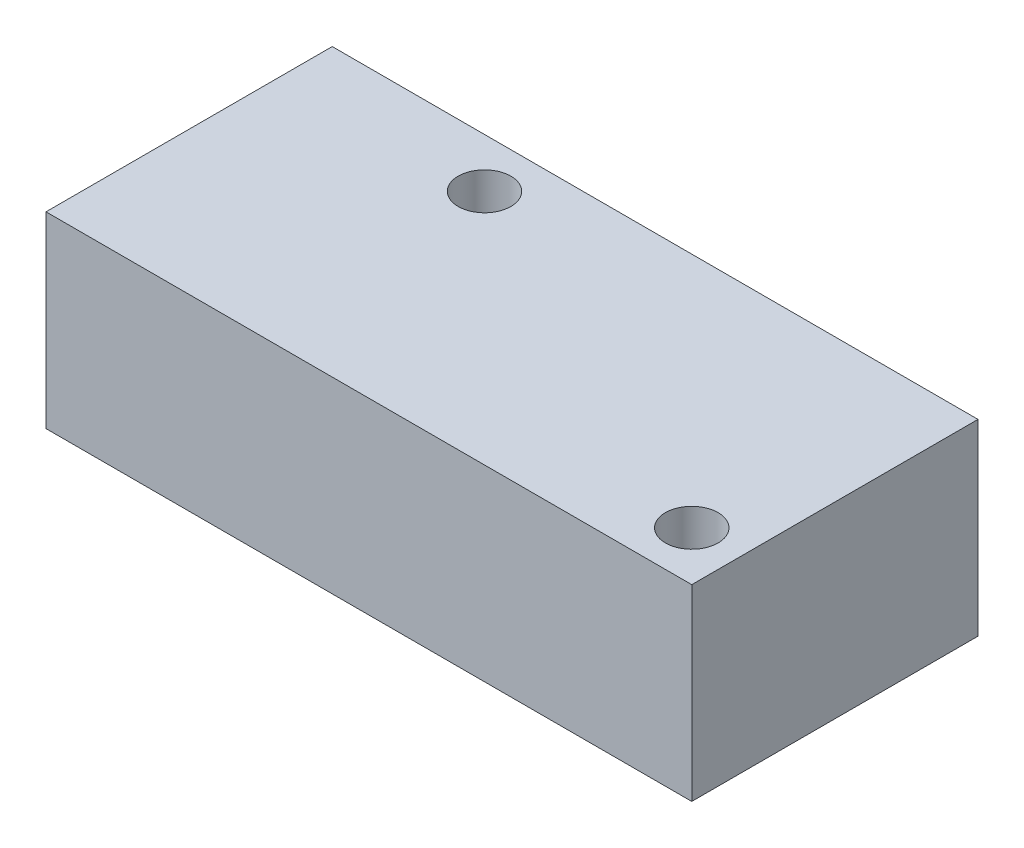
ISO-10303-21;
HEADER;
FILE_DESCRIPTION(('STEP AP214'),'2;1');
FILE_NAME('part.step','',(''),(''),'','','');
FILE_SCHEMA(('AUTOMOTIVE_DESIGN { 1 0 10303 214 1 1 1 1 }'));
ENDSEC;
DATA;
#1=APPLICATION_CONTEXT('core data for automotive mechanical design processes');
#2=APPLICATION_PROTOCOL_DEFINITION('international standard','automotive_design',2000,#1);
#3=PRODUCT_CONTEXT('',#1,'mechanical');
#4=PRODUCT('Part','Part','',(#3));
#5=PRODUCT_RELATED_PRODUCT_CATEGORY('part','',(#4));
#6=PRODUCT_DEFINITION_FORMATION('','',#4);
#7=PRODUCT_DEFINITION_CONTEXT('part definition',#1,'design');
#8=PRODUCT_DEFINITION('design','',#6,#7);
#9=PRODUCT_DEFINITION_SHAPE('','',#8);
#10=(LENGTH_UNIT() NAMED_UNIT(*) SI_UNIT(.MILLI.,.METRE.));
#11=(NAMED_UNIT(*) PLANE_ANGLE_UNIT() SI_UNIT($,.RADIAN.));
#12=(NAMED_UNIT(*) SI_UNIT($,.STERADIAN.) SOLID_ANGLE_UNIT());
#13=UNCERTAINTY_MEASURE_WITH_UNIT(LENGTH_MEASURE(1.E-05),#10,'distance_accuracy_value','');
#14=(GEOMETRIC_REPRESENTATION_CONTEXT(3) GLOBAL_UNCERTAINTY_ASSIGNED_CONTEXT((#13)) GLOBAL_UNIT_ASSIGNED_CONTEXT((#10,
#11,#12)) REPRESENTATION_CONTEXT('',''));
#15=CARTESIAN_POINT('',(0.,0.,0.));
#16=DIRECTION('',(0.,0.,1.));
#17=DIRECTION('',(1.,0.,0.));
#18=AXIS2_PLACEMENT_3D('',#15,#16,#17);
#19=CARTESIAN_POINT('',(0.,10.414,0.));
#20=DIRECTION('',(0.,-1.,0.));
#21=DIRECTION('',(0.,0.,-1.));
#22=AXIS2_PLACEMENT_3D('',#19,#20,#21);
#23=PLANE('',#22);
#24=DIRECTION('',(0.,0.,1.));
#25=VECTOR('',#24,1.);
#26=CARTESIAN_POINT('',(-1.51123052216527,10.414,0.));
#27=LINE('',#26,#25);
#28=CARTESIAN_POINT('',(-1.51123052216527,10.414,-15.875));
#29=VERTEX_POINT('',#28);
#30=CARTESIAN_POINT('',(-1.51123052216527,10.414,0.));
#31=VERTEX_POINT('',#30);
#32=EDGE_CURVE('E86',#29,#31,#27,.T.);
#33=ORIENTED_EDGE('',*,*,#32,.T.);
#34=DIRECTION('',(1.,0.,0.));
#35=VECTOR('',#34,1.);
#36=CARTESIAN_POINT('',(-1.51123052216527,10.414,0.));
#37=LINE('',#36,#35);
#38=CARTESIAN_POINT('',(34.3027694778347,10.414,0.));
#39=VERTEX_POINT('',#38);
#40=EDGE_CURVE('E81',#31,#39,#37,.T.);
#41=ORIENTED_EDGE('',*,*,#40,.T.);
#42=DIRECTION('',(0.,0.,-1.));
#43=VECTOR('',#42,1.);
#44=CARTESIAN_POINT('',(34.3027694778347,10.414,0.));
#45=LINE('',#44,#43);
#46=CARTESIAN_POINT('',(34.3027694778347,10.414,-15.875));
#47=VERTEX_POINT('',#46);
#48=EDGE_CURVE('E84',#39,#47,#45,.T.);
#49=ORIENTED_EDGE('',*,*,#48,.T.);
#50=DIRECTION('',(-1.,0.,0.));
#51=VECTOR('',#50,1.);
#52=CARTESIAN_POINT('',(-1.51123052216527,10.414,-15.875));
#53=LINE('',#52,#51);
#54=EDGE_CURVE('E51',#47,#29,#53,.T.);
#55=ORIENTED_EDGE('',*,*,#54,.T.);
#56=EDGE_LOOP('',(#33,#41,#49,#55));
#57=FACE_BOUND('',#56,.T.);
#58=CARTESIAN_POINT('',(9.66476947783473,10.414,-13.1445));
#59=DIRECTION('',(0.,1.,0.));
#60=DIRECTION('',(0.,0.,1.));
#61=AXIS2_PLACEMENT_3D('',#58,#59,#60);
#62=CIRCLE('',#61,1.4605);
#63=CARTESIAN_POINT('',(9.66476947783473,10.414,-11.684));
#64=VERTEX_POINT('',#63);
#65=EDGE_CURVE('E101',#64,#64,#62,.T.);
#66=ORIENTED_EDGE('',*,*,#65,.F.);
#67=EDGE_LOOP('',(#66));
#68=FACE_BOUND('',#67,.T.);
#69=CARTESIAN_POINT('',(31.5722694778347,10.414,-2.7305));
#70=DIRECTION('',(0.,1.,0.));
#71=DIRECTION('',(0.,0.,1.));
#72=AXIS2_PLACEMENT_3D('',#69,#70,#71);
#73=CIRCLE('',#72,1.46050000000001);
#74=CARTESIAN_POINT('',(31.5722694778347,10.414,-1.26999999999999));
#75=VERTEX_POINT('',#74);
#76=EDGE_CURVE('E116',#75,#75,#73,.T.);
#77=ORIENTED_EDGE('',*,*,#76,.F.);
#78=EDGE_LOOP('',(#77));
#79=FACE_BOUND('',#78,.T.);
#80=ADVANCED_FACE('F34',(#57,#68,#79),#23,.F.);
#81=CARTESIAN_POINT('',(0.,0.,0.));
#82=DIRECTION('',(0.,-1.,0.));
#83=DIRECTION('',(0.,0.,-1.));
#84=AXIS2_PLACEMENT_3D('',#81,#82,#83);
#85=PLANE('',#84);
#86=CARTESIAN_POINT('',(9.66476947783473,0.,-13.1445));
#87=DIRECTION('',(0.,1.,0.));
#88=DIRECTION('',(0.,0.,1.));
#89=AXIS2_PLACEMENT_3D('',#86,#87,#88);
#90=CIRCLE('',#89,1.4605);
#91=CARTESIAN_POINT('',(9.66476947783473,0.,-11.684));
#92=VERTEX_POINT('',#91);
#93=EDGE_CURVE('E113',#92,#92,#90,.T.);
#94=ORIENTED_EDGE('',*,*,#93,.T.);
#95=EDGE_LOOP('',(#94));
#96=FACE_BOUND('',#95,.T.);
#97=DIRECTION('',(0.,0.,1.));
#98=VECTOR('',#97,1.);
#99=CARTESIAN_POINT('',(-1.51123052216527,0.,0.));
#100=LINE('',#99,#98);
#101=CARTESIAN_POINT('',(-1.51123052216527,0.,-15.875));
#102=VERTEX_POINT('',#101);
#103=CARTESIAN_POINT('',(-1.51123052216527,0.,0.));
#104=VERTEX_POINT('',#103);
#105=EDGE_CURVE('E98',#102,#104,#100,.T.);
#106=ORIENTED_EDGE('',*,*,#105,.F.);
#107=DIRECTION('',(-1.,0.,0.));
#108=VECTOR('',#107,1.);
#109=CARTESIAN_POINT('',(-1.51123052216527,0.,-15.875));
#110=LINE('',#109,#108);
#111=CARTESIAN_POINT('',(34.3027694778347,0.,-15.875));
#112=VERTEX_POINT('',#111);
#113=EDGE_CURVE('E74',#112,#102,#110,.T.);
#114=ORIENTED_EDGE('',*,*,#113,.F.);
#115=DIRECTION('',(0.,0.,-1.));
#116=VECTOR('',#115,1.);
#117=CARTESIAN_POINT('',(34.3027694778347,0.,0.));
#118=LINE('',#117,#116);
#119=CARTESIAN_POINT('',(34.3027694778347,0.,0.));
#120=VERTEX_POINT('',#119);
#121=EDGE_CURVE('E68',#120,#112,#118,.T.);
#122=ORIENTED_EDGE('',*,*,#121,.F.);
#123=DIRECTION('',(1.,0.,0.));
#124=VECTOR('',#123,1.);
#125=CARTESIAN_POINT('',(-1.51123052216527,0.,0.));
#126=LINE('',#125,#124);
#127=EDGE_CURVE('E90',#104,#120,#126,.T.);
#128=ORIENTED_EDGE('',*,*,#127,.F.);
#129=EDGE_LOOP('',(#106,#114,#122,#128));
#130=FACE_BOUND('',#129,.T.);
#131=CARTESIAN_POINT('',(31.5722694778347,0.,-2.7305));
#132=DIRECTION('',(0.,1.,0.));
#133=DIRECTION('',(0.,0.,1.));
#134=AXIS2_PLACEMENT_3D('',#131,#132,#133);
#135=CIRCLE('',#134,1.46050000000001);
#136=CARTESIAN_POINT('',(31.5722694778347,0.,-1.26999999999999));
#137=VERTEX_POINT('',#136);
#138=EDGE_CURVE('E119',#137,#137,#135,.T.);
#139=ORIENTED_EDGE('',*,*,#138,.T.);
#140=EDGE_LOOP('',(#139));
#141=FACE_BOUND('',#140,.T.);
#142=ADVANCED_FACE('F109',(#96,#130,#141),#85,.T.);
#143=CARTESIAN_POINT('',(-1.51123052216527,10.414,0.));
#144=DIRECTION('',(1.,0.,0.));
#145=DIRECTION('',(0.,0.,-1.));
#146=AXIS2_PLACEMENT_3D('',#143,#144,#145);
#147=PLANE('',#146);
#148=ORIENTED_EDGE('',*,*,#105,.T.);
#149=DIRECTION('',(0.,-1.,0.));
#150=VECTOR('',#149,1.);
#151=CARTESIAN_POINT('',(-1.51123052216527,10.414,0.));
#152=LINE('',#151,#150);
#153=EDGE_CURVE('E11',#31,#104,#152,.T.);
#154=ORIENTED_EDGE('',*,*,#153,.F.);
#155=ORIENTED_EDGE('',*,*,#32,.F.);
#156=DIRECTION('',(0.,-1.,0.));
#157=VECTOR('',#156,1.);
#158=CARTESIAN_POINT('',(-1.51123052216527,10.414,-15.875));
#159=LINE('',#158,#157);
#160=EDGE_CURVE('E94',#29,#102,#159,.T.);
#161=ORIENTED_EDGE('',*,*,#160,.T.);
#162=EDGE_LOOP('',(#148,#154,#155,#161));
#163=FACE_BOUND('',#162,.T.);
#164=ADVANCED_FACE('F36',(#163),#147,.F.);
#165=CARTESIAN_POINT('',(-1.51123052216527,10.414,0.));
#166=DIRECTION('',(0.,0.,-1.));
#167=DIRECTION('',(-1.,0.,0.));
#168=AXIS2_PLACEMENT_3D('',#165,#166,#167);
#169=PLANE('',#168);
#170=ORIENTED_EDGE('',*,*,#127,.T.);
#171=DIRECTION('',(0.,-1.,0.));
#172=VECTOR('',#171,1.);
#173=CARTESIAN_POINT('',(34.3027694778347,10.414,0.));
#174=LINE('',#173,#172);
#175=EDGE_CURVE('E43',#39,#120,#174,.T.);
#176=ORIENTED_EDGE('',*,*,#175,.F.);
#177=ORIENTED_EDGE('',*,*,#40,.F.);
#178=ORIENTED_EDGE('',*,*,#153,.T.);
#179=EDGE_LOOP('',(#170,#176,#177,#178));
#180=FACE_BOUND('',#179,.T.);
#181=ADVANCED_FACE('F89',(#180),#169,.F.);
#182=CARTESIAN_POINT('',(34.3027694778347,10.414,0.));
#183=DIRECTION('',(-1.,0.,0.));
#184=DIRECTION('',(0.,0.,1.));
#185=AXIS2_PLACEMENT_3D('',#182,#183,#184);
#186=PLANE('',#185);
#187=ORIENTED_EDGE('',*,*,#121,.T.);
#188=DIRECTION('',(0.,-1.,0.));
#189=VECTOR('',#188,1.);
#190=CARTESIAN_POINT('',(34.3027694778347,10.414,-15.875));
#191=LINE('',#190,#189);
#192=EDGE_CURVE('E91',#47,#112,#191,.T.);
#193=ORIENTED_EDGE('',*,*,#192,.F.);
#194=ORIENTED_EDGE('',*,*,#48,.F.);
#195=ORIENTED_EDGE('',*,*,#175,.T.);
#196=EDGE_LOOP('',(#187,#193,#194,#195));
#197=FACE_BOUND('',#196,.T.);
#198=ADVANCED_FACE('F92',(#197),#186,.F.);
#199=CARTESIAN_POINT('',(-1.51123052216527,10.414,-15.875));
#200=DIRECTION('',(0.,0.,1.));
#201=DIRECTION('',(1.,0.,0.));
#202=AXIS2_PLACEMENT_3D('',#199,#200,#201);
#203=PLANE('',#202);
#204=ORIENTED_EDGE('',*,*,#113,.T.);
#205=ORIENTED_EDGE('',*,*,#160,.F.);
#206=ORIENTED_EDGE('',*,*,#54,.F.);
#207=ORIENTED_EDGE('',*,*,#192,.T.);
#208=EDGE_LOOP('',(#204,#205,#206,#207));
#209=FACE_BOUND('',#208,.T.);
#210=ADVANCED_FACE('F106',(#209),#203,.F.);
#211=CARTESIAN_POINT('',(9.66476947783473,10.414,-13.1445));
#212=DIRECTION('',(0.,-1.,0.));
#213=DIRECTION('',(0.,0.,-1.));
#214=AXIS2_PLACEMENT_3D('',#211,#212,#213);
#215=CYLINDRICAL_SURFACE('',#214,1.4605);
#216=ORIENTED_EDGE('',*,*,#65,.T.);
#217=EDGE_LOOP('',(#216));
#218=FACE_BOUND('',#217,.T.);
#219=ORIENTED_EDGE('',*,*,#93,.F.);
#220=EDGE_LOOP('',(#219));
#221=FACE_BOUND('',#220,.T.);
#222=ADVANCED_FACE('F136',(#218,#221),#215,.F.);
#223=CARTESIAN_POINT('',(31.5722694778347,10.414,-2.7305));
#224=DIRECTION('',(0.,-1.,0.));
#225=DIRECTION('',(0.,0.,-1.));
#226=AXIS2_PLACEMENT_3D('',#223,#224,#225);
#227=CYLINDRICAL_SURFACE('',#226,1.46050000000001);
#228=ORIENTED_EDGE('',*,*,#76,.T.);
#229=EDGE_LOOP('',(#228));
#230=FACE_BOUND('',#229,.T.);
#231=ORIENTED_EDGE('',*,*,#138,.F.);
#232=EDGE_LOOP('',(#231));
#233=FACE_BOUND('',#232,.T.);
#234=ADVANCED_FACE('F125',(#230,#233),#227,.F.);
#235=CLOSED_SHELL('',(#80,#142,#164,#181,#198,#210,#222,#234));
#236=MANIFOLD_SOLID_BREP('B2',#235);
#237=ADVANCED_BREP_SHAPE_REPRESENTATION('',(#18,#236),#14);
#238=SHAPE_DEFINITION_REPRESENTATION(#9,#237);
ENDSEC;
END-ISO-10303-21;
